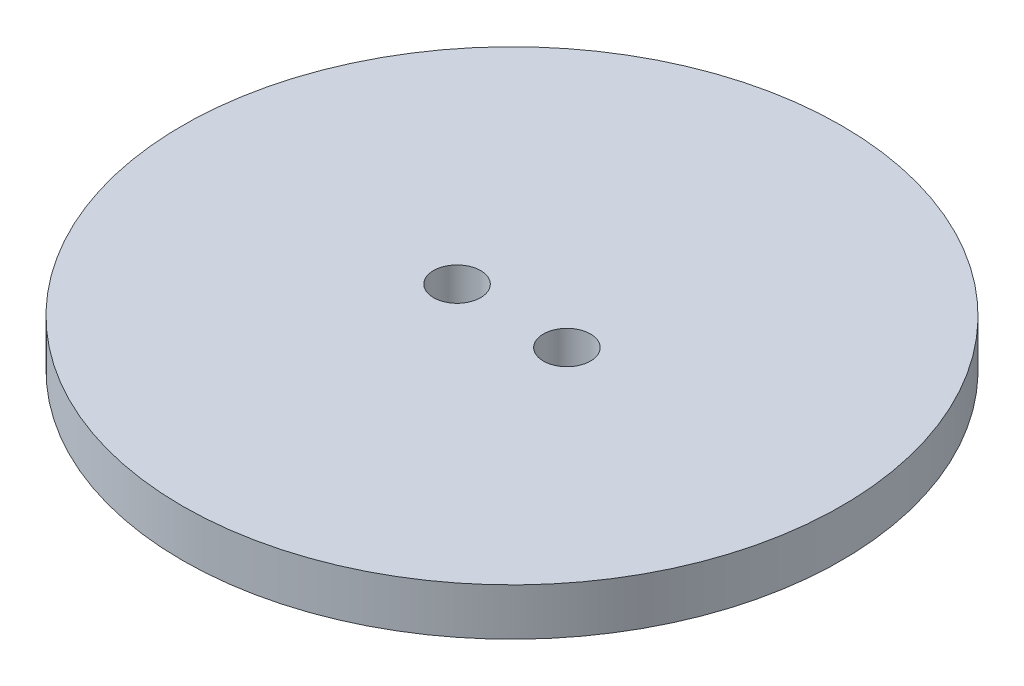
ISO-10303-21;
HEADER;
FILE_DESCRIPTION(('STEP AP214'),'2;1');
FILE_NAME('part.step','',(''),(''),'','','');
FILE_SCHEMA(('AUTOMOTIVE_DESIGN { 1 0 10303 214 1 1 1 1 }'));
ENDSEC;
DATA;
#1=APPLICATION_CONTEXT('core data for automotive mechanical design processes');
#2=APPLICATION_PROTOCOL_DEFINITION('international standard','automotive_design',2000,#1);
#3=PRODUCT_CONTEXT('',#1,'mechanical');
#4=PRODUCT('Part','Part','',(#3));
#5=PRODUCT_RELATED_PRODUCT_CATEGORY('part','',(#4));
#6=PRODUCT_DEFINITION_FORMATION('','',#4);
#7=PRODUCT_DEFINITION_CONTEXT('part definition',#1,'design');
#8=PRODUCT_DEFINITION('design','',#6,#7);
#9=PRODUCT_DEFINITION_SHAPE('','',#8);
#10=(LENGTH_UNIT() NAMED_UNIT(*) SI_UNIT(.MILLI.,.METRE.));
#11=(NAMED_UNIT(*) PLANE_ANGLE_UNIT() SI_UNIT($,.RADIAN.));
#12=(NAMED_UNIT(*) SI_UNIT($,.STERADIAN.) SOLID_ANGLE_UNIT());
#13=UNCERTAINTY_MEASURE_WITH_UNIT(LENGTH_MEASURE(1.E-05),#10,'distance_accuracy_value','');
#14=(GEOMETRIC_REPRESENTATION_CONTEXT(3) GLOBAL_UNCERTAINTY_ASSIGNED_CONTEXT((#13)) GLOBAL_UNIT_ASSIGNED_CONTEXT((#10,
#11,#12)) REPRESENTATION_CONTEXT('',''));
#15=CARTESIAN_POINT('',(0.,0.,0.));
#16=DIRECTION('',(0.,0.,1.));
#17=DIRECTION('',(1.,0.,0.));
#18=AXIS2_PLACEMENT_3D('',#15,#16,#17);
#19=CARTESIAN_POINT('',(0.,3.,0.));
#20=DIRECTION('',(0.,1.,0.));
#21=DIRECTION('',(0.,0.,1.));
#22=AXIS2_PLACEMENT_3D('',#19,#20,#21);
#23=PLANE('',#22);
#24=CARTESIAN_POINT('',(-3.5,3.,0.));
#25=DIRECTION('',(0.,1.,0.));
#26=DIRECTION('',(0.,0.,1.));
#27=AXIS2_PLACEMENT_3D('',#24,#25,#26);
#28=CIRCLE('',#27,1.5);
#29=CARTESIAN_POINT('',(-3.5,3.,1.5));
#30=VERTEX_POINT('',#29);
#31=EDGE_CURVE('E44',#30,#30,#28,.T.);
#32=ORIENTED_EDGE('',*,*,#31,.F.);
#33=EDGE_LOOP('',(#32));
#34=FACE_BOUND('',#33,.T.);
#35=CARTESIAN_POINT('',(0.,3.,0.));
#36=DIRECTION('',(0.,1.,0.));
#37=DIRECTION('',(0.,0.,1.));
#38=AXIS2_PLACEMENT_3D('',#35,#36,#37);
#39=CIRCLE('',#38,21.);
#40=CARTESIAN_POINT('',(0.,3.,21.));
#41=VERTEX_POINT('',#40);
#42=EDGE_CURVE('E10',#41,#41,#39,.T.);
#43=ORIENTED_EDGE('',*,*,#42,.T.);
#44=EDGE_LOOP('',(#43));
#45=FACE_BOUND('',#44,.T.);
#46=CARTESIAN_POINT('',(3.5,3.,0.));
#47=DIRECTION('',(0.,1.,0.));
#48=DIRECTION('',(0.,0.,1.));
#49=AXIS2_PLACEMENT_3D('',#46,#47,#48);
#50=CIRCLE('',#49,1.5);
#51=CARTESIAN_POINT('',(3.5,3.,1.5));
#52=VERTEX_POINT('',#51);
#53=EDGE_CURVE('E49',#52,#52,#50,.T.);
#54=ORIENTED_EDGE('',*,*,#53,.F.);
#55=EDGE_LOOP('',(#54));
#56=FACE_BOUND('',#55,.T.);
#57=ADVANCED_FACE('F33',(#34,#45,#56),#23,.T.);
#58=CARTESIAN_POINT('',(0.,0.,0.));
#59=DIRECTION('',(0.,1.,0.));
#60=DIRECTION('',(0.,0.,1.));
#61=AXIS2_PLACEMENT_3D('',#58,#59,#60);
#62=PLANE('',#61);
#63=CARTESIAN_POINT('',(0.,0.,0.));
#64=DIRECTION('',(0.,1.,0.));
#65=DIRECTION('',(0.,0.,1.));
#66=AXIS2_PLACEMENT_3D('',#63,#64,#65);
#67=CIRCLE('',#66,21.);
#68=CARTESIAN_POINT('',(0.,0.,21.));
#69=VERTEX_POINT('',#68);
#70=EDGE_CURVE('E37',#69,#69,#67,.T.);
#71=ORIENTED_EDGE('',*,*,#70,.F.);
#72=EDGE_LOOP('',(#71));
#73=FACE_BOUND('',#72,.T.);
#74=CARTESIAN_POINT('',(-3.5,0.,0.));
#75=DIRECTION('',(0.,1.,0.));
#76=DIRECTION('',(0.,0.,1.));
#77=AXIS2_PLACEMENT_3D('',#74,#75,#76);
#78=CIRCLE('',#77,1.5);
#79=CARTESIAN_POINT('',(-3.5,0.,1.5));
#80=VERTEX_POINT('',#79);
#81=EDGE_CURVE('E46',#80,#80,#78,.T.);
#82=ORIENTED_EDGE('',*,*,#81,.T.);
#83=EDGE_LOOP('',(#82));
#84=FACE_BOUND('',#83,.T.);
#85=CARTESIAN_POINT('',(3.5,0.,0.));
#86=DIRECTION('',(0.,1.,0.));
#87=DIRECTION('',(0.,0.,1.));
#88=AXIS2_PLACEMENT_3D('',#85,#86,#87);
#89=CIRCLE('',#88,1.5);
#90=CARTESIAN_POINT('',(3.5,0.,1.5));
#91=VERTEX_POINT('',#90);
#92=EDGE_CURVE('E52',#91,#91,#89,.T.);
#93=ORIENTED_EDGE('',*,*,#92,.T.);
#94=EDGE_LOOP('',(#93));
#95=FACE_BOUND('',#94,.T.);
#96=ADVANCED_FACE('F62',(#73,#84,#95),#62,.F.);
#97=CARTESIAN_POINT('',(0.,3.,0.));
#98=DIRECTION('',(0.,-1.,0.));
#99=DIRECTION('',(0.,0.,-1.));
#100=AXIS2_PLACEMENT_3D('',#97,#98,#99);
#101=CYLINDRICAL_SURFACE('',#100,21.);
#102=ORIENTED_EDGE('',*,*,#42,.F.);
#103=EDGE_LOOP('',(#102));
#104=FACE_BOUND('',#103,.T.);
#105=ORIENTED_EDGE('',*,*,#70,.T.);
#106=EDGE_LOOP('',(#105));
#107=FACE_BOUND('',#106,.T.);
#108=ADVANCED_FACE('F35',(#104,#107),#101,.T.);
#109=CARTESIAN_POINT('',(-3.5,3.,0.));
#110=DIRECTION('',(0.,-1.,0.));
#111=DIRECTION('',(0.,0.,-1.));
#112=AXIS2_PLACEMENT_3D('',#109,#110,#111);
#113=CYLINDRICAL_SURFACE('',#112,1.5);
#114=ORIENTED_EDGE('',*,*,#31,.T.);
#115=EDGE_LOOP('',(#114));
#116=FACE_BOUND('',#115,.T.);
#117=ORIENTED_EDGE('',*,*,#81,.F.);
#118=EDGE_LOOP('',(#117));
#119=FACE_BOUND('',#118,.T.);
#120=ADVANCED_FACE('F71',(#116,#119),#113,.F.);
#121=CARTESIAN_POINT('',(3.5,3.,0.));
#122=DIRECTION('',(0.,-1.,0.));
#123=DIRECTION('',(0.,0.,-1.));
#124=AXIS2_PLACEMENT_3D('',#121,#122,#123);
#125=CYLINDRICAL_SURFACE('',#124,1.5);
#126=ORIENTED_EDGE('',*,*,#53,.T.);
#127=EDGE_LOOP('',(#126));
#128=FACE_BOUND('',#127,.T.);
#129=ORIENTED_EDGE('',*,*,#92,.F.);
#130=EDGE_LOOP('',(#129));
#131=FACE_BOUND('',#130,.T.);
#132=ADVANCED_FACE('F58',(#128,#131),#125,.F.);
#133=CLOSED_SHELL('',(#57,#96,#108,#120,#132));
#134=MANIFOLD_SOLID_BREP('B2',#133);
#135=ADVANCED_BREP_SHAPE_REPRESENTATION('',(#18,#134),#14);
#136=SHAPE_DEFINITION_REPRESENTATION(#9,#135);
ENDSEC;
END-ISO-10303-21;
